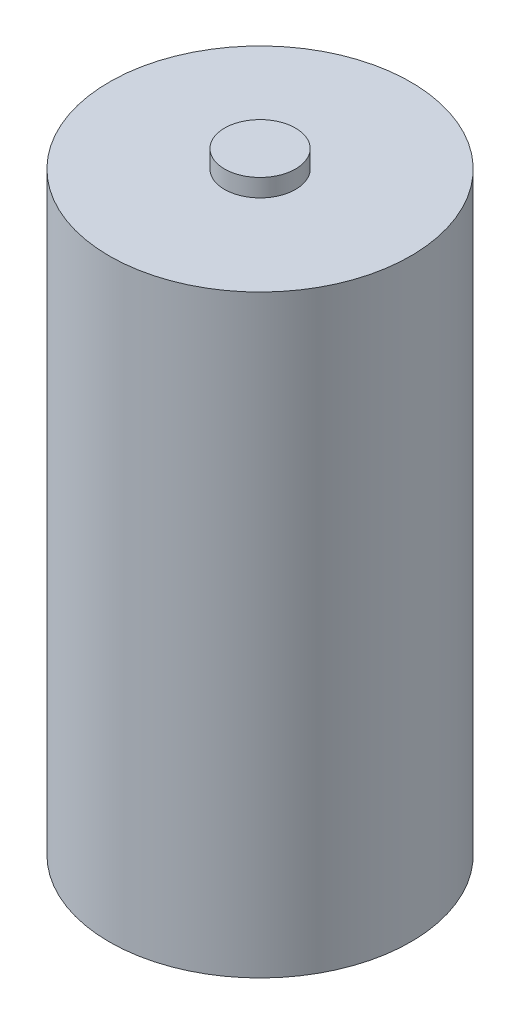
ISO-10303-21;
HEADER;
FILE_DESCRIPTION(('STEP AP214'),'2;1');
FILE_NAME('part.step','',(''),(''),'','','');
FILE_SCHEMA(('AUTOMOTIVE_DESIGN { 1 0 10303 214 1 1 1 1 }'));
ENDSEC;
DATA;
#1=APPLICATION_CONTEXT('core data for automotive mechanical design processes');
#2=APPLICATION_PROTOCOL_DEFINITION('international standard','automotive_design',2000,#1);
#3=PRODUCT_CONTEXT('',#1,'mechanical');
#4=PRODUCT('Part','Part','',(#3));
#5=PRODUCT_RELATED_PRODUCT_CATEGORY('part','',(#4));
#6=PRODUCT_DEFINITION_FORMATION('','',#4);
#7=PRODUCT_DEFINITION_CONTEXT('part definition',#1,'design');
#8=PRODUCT_DEFINITION('design','',#6,#7);
#9=PRODUCT_DEFINITION_SHAPE('','',#8);
#10=(LENGTH_UNIT() NAMED_UNIT(*) SI_UNIT(.MILLI.,.METRE.));
#11=(NAMED_UNIT(*) PLANE_ANGLE_UNIT() SI_UNIT($,.RADIAN.));
#12=(NAMED_UNIT(*) SI_UNIT($,.STERADIAN.) SOLID_ANGLE_UNIT());
#13=UNCERTAINTY_MEASURE_WITH_UNIT(LENGTH_MEASURE(1.E-05),#10,'distance_accuracy_value','');
#14=(GEOMETRIC_REPRESENTATION_CONTEXT(3) GLOBAL_UNCERTAINTY_ASSIGNED_CONTEXT((#13)) GLOBAL_UNIT_ASSIGNED_CONTEXT((#10,
#11,#12)) REPRESENTATION_CONTEXT('',''));
#15=CARTESIAN_POINT('',(0.,0.,0.));
#16=DIRECTION('',(0.,0.,1.));
#17=DIRECTION('',(1.,0.,0.));
#18=AXIS2_PLACEMENT_3D('',#15,#16,#17);
#19=CARTESIAN_POINT('',(0.,0.,0.));
#20=DIRECTION('',(0.,-1.,0.));
#21=DIRECTION('',(0.,0.,-1.));
#22=AXIS2_PLACEMENT_3D('',#19,#20,#21);
#23=PLANE('',#22);
#24=CARTESIAN_POINT('',(0.,0.,0.));
#25=DIRECTION('',(0.,1.,0.));
#26=DIRECTION('',(0.,0.,1.));
#27=AXIS2_PLACEMENT_3D('',#24,#25,#26);
#28=CIRCLE('',#27,8.5);
#29=CARTESIAN_POINT('',(0.,0.,8.5));
#30=VERTEX_POINT('',#29);
#31=EDGE_CURVE('E10',#30,#30,#28,.T.);
#32=ORIENTED_EDGE('',*,*,#31,.F.);
#33=EDGE_LOOP('',(#32));
#34=FACE_BOUND('',#33,.T.);
#35=ADVANCED_FACE('F30',(#34),#23,.T.);
#36=CARTESIAN_POINT('',(0.,34.5,0.));
#37=DIRECTION('',(0.,1.,0.));
#38=DIRECTION('',(0.,0.,1.));
#39=AXIS2_PLACEMENT_3D('',#36,#37,#38);
#40=CYLINDRICAL_SURFACE('',#39,8.5);
#41=ORIENTED_EDGE('',*,*,#31,.T.);
#42=EDGE_LOOP('',(#41));
#43=FACE_BOUND('',#42,.T.);
#44=CARTESIAN_POINT('',(0.,33.5,0.));
#45=DIRECTION('',(0.,1.,0.));
#46=DIRECTION('',(0.,0.,1.));
#47=AXIS2_PLACEMENT_3D('',#44,#45,#46);
#48=CIRCLE('',#47,8.5);
#49=CARTESIAN_POINT('',(0.,33.5,8.5));
#50=VERTEX_POINT('',#49);
#51=EDGE_CURVE('E36',#50,#50,#48,.T.);
#52=ORIENTED_EDGE('',*,*,#51,.F.);
#53=EDGE_LOOP('',(#52));
#54=FACE_BOUND('',#53,.T.);
#55=ADVANCED_FACE('F62',(#43,#54),#40,.T.);
#56=CARTESIAN_POINT('',(-8.5,33.5,0.));
#57=DIRECTION('',(0.,1.,0.));
#58=DIRECTION('',(0.,0.,1.));
#59=AXIS2_PLACEMENT_3D('',#56,#57,#58);
#60=PLANE('',#59);
#61=ORIENTED_EDGE('',*,*,#51,.T.);
#62=EDGE_LOOP('',(#61));
#63=FACE_BOUND('',#62,.T.);
#64=CARTESIAN_POINT('',(0.,33.5,0.));
#65=DIRECTION('',(0.,1.,0.));
#66=DIRECTION('',(0.,0.,1.));
#67=AXIS2_PLACEMENT_3D('',#64,#65,#66);
#68=CIRCLE('',#67,2.);
#69=CARTESIAN_POINT('',(0.,33.5,2.));
#70=VERTEX_POINT('',#69);
#71=EDGE_CURVE('E40',#70,#70,#68,.T.);
#72=ORIENTED_EDGE('',*,*,#71,.F.);
#73=EDGE_LOOP('',(#72));
#74=FACE_BOUND('',#73,.T.);
#75=ADVANCED_FACE('F54',(#63,#74),#60,.T.);
#76=CARTESIAN_POINT('',(0.,34.5,0.));
#77=DIRECTION('',(0.,1.,0.));
#78=DIRECTION('',(0.,0.,1.));
#79=AXIS2_PLACEMENT_3D('',#76,#77,#78);
#80=CYLINDRICAL_SURFACE('',#79,2.);
#81=ORIENTED_EDGE('',*,*,#71,.T.);
#82=EDGE_LOOP('',(#81));
#83=FACE_BOUND('',#82,.T.);
#84=CARTESIAN_POINT('',(0.,34.5,0.));
#85=DIRECTION('',(0.,1.,0.));
#86=DIRECTION('',(0.,0.,1.));
#87=AXIS2_PLACEMENT_3D('',#84,#85,#86);
#88=CIRCLE('',#87,2.);
#89=CARTESIAN_POINT('',(0.,34.5,2.));
#90=VERTEX_POINT('',#89);
#91=EDGE_CURVE('E44',#90,#90,#88,.T.);
#92=ORIENTED_EDGE('',*,*,#91,.F.);
#93=EDGE_LOOP('',(#92));
#94=FACE_BOUND('',#93,.T.);
#95=ADVANCED_FACE('F52',(#83,#94),#80,.T.);
#96=CARTESIAN_POINT('',(-2.,34.5,0.));
#97=DIRECTION('',(0.,1.,0.));
#98=DIRECTION('',(0.,0.,1.));
#99=AXIS2_PLACEMENT_3D('',#96,#97,#98);
#100=PLANE('',#99);
#101=ORIENTED_EDGE('',*,*,#91,.T.);
#102=EDGE_LOOP('',(#101));
#103=FACE_BOUND('',#102,.T.);
#104=ADVANCED_FACE('F50',(#103),#100,.T.);
#105=CLOSED_SHELL('',(#35,#55,#75,#95,#104));
#106=MANIFOLD_SOLID_BREP('B2',#105);
#107=ADVANCED_BREP_SHAPE_REPRESENTATION('',(#18,#106),#14);
#108=SHAPE_DEFINITION_REPRESENTATION(#9,#107);
ENDSEC;
END-ISO-10303-21;
